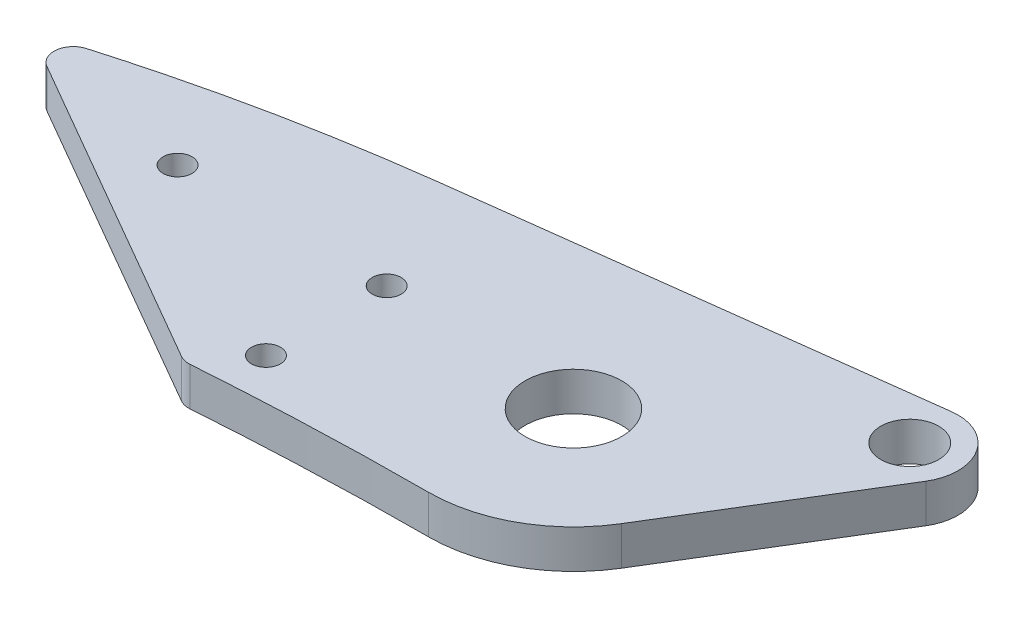
ISO-10303-21;
HEADER;
FILE_DESCRIPTION(('STEP AP214'),'2;1');
FILE_NAME('part.step','',(''),(''),'','','');
FILE_SCHEMA(('AUTOMOTIVE_DESIGN { 1 0 10303 214 1 1 1 1 }'));
ENDSEC;
DATA;
#1=APPLICATION_CONTEXT('core data for automotive mechanical design processes');
#2=APPLICATION_PROTOCOL_DEFINITION('international standard','automotive_design',2000,#1);
#3=PRODUCT_CONTEXT('',#1,'mechanical');
#4=PRODUCT('Part','Part','',(#3));
#5=PRODUCT_RELATED_PRODUCT_CATEGORY('part','',(#4));
#6=PRODUCT_DEFINITION_FORMATION('','',#4);
#7=PRODUCT_DEFINITION_CONTEXT('part definition',#1,'design');
#8=PRODUCT_DEFINITION('design','',#6,#7);
#9=PRODUCT_DEFINITION_SHAPE('','',#8);
#10=(LENGTH_UNIT() NAMED_UNIT(*) SI_UNIT(.MILLI.,.METRE.));
#11=(NAMED_UNIT(*) PLANE_ANGLE_UNIT() SI_UNIT($,.RADIAN.));
#12=(NAMED_UNIT(*) SI_UNIT($,.STERADIAN.) SOLID_ANGLE_UNIT());
#13=UNCERTAINTY_MEASURE_WITH_UNIT(LENGTH_MEASURE(1.E-05),#10,'distance_accuracy_value','');
#14=(GEOMETRIC_REPRESENTATION_CONTEXT(3) GLOBAL_UNCERTAINTY_ASSIGNED_CONTEXT((#13)) GLOBAL_UNIT_ASSIGNED_CONTEXT((#10,
#11,#12)) REPRESENTATION_CONTEXT('',''));
#15=CARTESIAN_POINT('',(0.,0.,0.));
#16=DIRECTION('',(0.,0.,1.));
#17=DIRECTION('',(1.,0.,0.));
#18=AXIS2_PLACEMENT_3D('',#15,#16,#17);
#19=CARTESIAN_POINT('',(0.,4.,0.));
#20=DIRECTION('',(0.,-1.,0.));
#21=DIRECTION('',(0.,0.,-1.));
#22=AXIS2_PLACEMENT_3D('',#19,#20,#21);
#23=CYLINDRICAL_SURFACE('',#22,15.);
#24=DIRECTION('',(0.,-1.,0.));
#25=VECTOR('',#24,1.);
#26=CARTESIAN_POINT('',(12.800284574999,4.,7.82002012779017));
#27=LINE('',#26,#25);
#28=CARTESIAN_POINT('',(12.800284574999,4.,7.82002012779017));
#29=VERTEX_POINT('',#28);
#30=CARTESIAN_POINT('',(12.800284574999,0.,7.82002012779017));
#31=VERTEX_POINT('',#30);
#32=EDGE_CURVE('E139',#29,#31,#27,.T.);
#33=ORIENTED_EDGE('',*,*,#32,.F.);
#34=CARTESIAN_POINT('',(0.,4.,0.));
#35=DIRECTION('',(0.,1.,0.));
#36=DIRECTION('',(0.,0.,1.));
#37=AXIS2_PLACEMENT_3D('',#34,#35,#36);
#38=CIRCLE('',#37,15.);
#39=CARTESIAN_POINT('',(0.,4.,15.));
#40=VERTEX_POINT('',#39);
#41=EDGE_CURVE('E126',#40,#29,#38,.T.);
#42=ORIENTED_EDGE('',*,*,#41,.F.);
#43=DIRECTION('',(0.,-1.,0.));
#44=VECTOR('',#43,1.);
#45=CARTESIAN_POINT('',(0.,4.,15.));
#46=LINE('',#45,#44);
#47=CARTESIAN_POINT('',(0.,0.,15.));
#48=VERTEX_POINT('',#47);
#49=EDGE_CURVE('E214',#40,#48,#46,.T.);
#50=ORIENTED_EDGE('',*,*,#49,.T.);
#51=CARTESIAN_POINT('',(0.,0.,0.));
#52=DIRECTION('',(0.,1.,0.));
#53=DIRECTION('',(0.,0.,1.));
#54=AXIS2_PLACEMENT_3D('',#51,#52,#53);
#55=CIRCLE('',#54,15.);
#56=EDGE_CURVE('E203',#48,#31,#55,.T.);
#57=ORIENTED_EDGE('',*,*,#56,.T.);
#58=EDGE_LOOP('',(#33,#42,#50,#57));
#59=FACE_BOUND('',#58,.T.);
#60=ADVANCED_FACE('F37',(#59),#23,.T.);
#61=CARTESIAN_POINT('',(0.,4.,15.));
#62=CARTESIAN_POINT('',(-49.2111716112706,4.,15.));
#63=CARTESIAN_POINT('',(-112.57781543997,4.,27.0169708024505));
#64=CARTESIAN_POINT('',(-144.167389056724,4.,51.5546731951299));
#65=B_SPLINE_CURVE_WITH_KNOTS('',3,(#61,#62,#63,#64),.UNSPECIFIED.,.F.,.F.,(4,4),(0.,1.),.UNSPECIFIED.);
#66=DIRECTION('',(0.,-1.,0.));
#67=VECTOR('',#66,1.);
#68=SURFACE_OF_LINEAR_EXTRUSION('',#65,#67);
#69=CARTESIAN_POINT('',(-23.8180350285036,4.,15.874105811846));
#70=VERTEX_POINT('',#69);
#71=EDGE_CURVE('E168',#40,#70,#65,.T.);
#72=ORIENTED_EDGE('',*,*,#71,.T.);
#73=DIRECTION('',(0.,-1.,0.));
#74=VECTOR('',#73,1.);
#75=CARTESIAN_POINT('',(-23.8180350285035,4.,15.874105811846));
#76=LINE('',#75,#74);
#77=CARTESIAN_POINT('',(-23.8180350285036,0.,15.874105811846));
#78=VERTEX_POINT('',#77);
#79=EDGE_CURVE('E62',#70,#78,#76,.T.);
#80=ORIENTED_EDGE('',*,*,#79,.T.);
#81=CARTESIAN_POINT('',(0.,0.,15.));
#82=CARTESIAN_POINT('',(-49.2111716112706,0.,15.));
#83=CARTESIAN_POINT('',(-112.57781543997,0.,27.0169708024505));
#84=CARTESIAN_POINT('',(-144.167389056724,0.,51.5546731951299));
#85=B_SPLINE_CURVE_WITH_KNOTS('',3,(#81,#82,#83,#84),.UNSPECIFIED.,.F.,.F.,(4,4),(0.,1.),.UNSPECIFIED.);
#86=EDGE_CURVE('E164',#48,#78,#85,.T.);
#87=ORIENTED_EDGE('',*,*,#86,.F.);
#88=ORIENTED_EDGE('',*,*,#49,.F.);
#89=EDGE_LOOP('',(#72,#80,#87,#88));
#90=FACE_BOUND('',#89,.T.);
#91=ADVANCED_FACE('F179',(#90),#68,.T.);
#92=CARTESIAN_POINT('',(0.,4.,-15.));
#93=CARTESIAN_POINT('',(-53.3333333333334,4.,-15.));
#94=CARTESIAN_POINT('',(-97.5832238129657,4.,2.85032711582573));
#95=CARTESIAN_POINT('',(-150.232513174223,4.,43.7464977702929));
#96=B_SPLINE_CURVE_WITH_KNOTS('',3,(#92,#93,#94,#95),.UNSPECIFIED.,.F.,.F.,(4,4),(0.,1.),.UNSPECIFIED.);
#97=DIRECTION('',(0.,-1.,0.));
#98=VECTOR('',#97,1.);
#99=SURFACE_OF_LINEAR_EXTRUSION('',#96,#98);
#100=CARTESIAN_POINT('',(0.,0.,-15.));
#101=CARTESIAN_POINT('',(-53.3333333333334,0.,-15.));
#102=CARTESIAN_POINT('',(-97.5832238129657,0.,2.85032711582573));
#103=CARTESIAN_POINT('',(-150.232513174223,0.,43.7464977702929));
#104=B_SPLINE_CURVE_WITH_KNOTS('',3,(#100,#101,#102,#103),.UNSPECIFIED.,.F.,.F.,(4,4),(0.,1.),.UNSPECIFIED.);
#105=CARTESIAN_POINT('',(-27.3151088710349,0.,-13.3250765524274));
#106=VERTEX_POINT('',#105);
#107=CARTESIAN_POINT('',(-57.4924891768514,0.,-7.07889253672707));
#108=VERTEX_POINT('',#107);
#109=EDGE_CURVE('E173',#106,#108,#104,.T.);
#110=ORIENTED_EDGE('',*,*,#109,.T.);
#111=DIRECTION('',(0.,-1.,0.));
#112=VECTOR('',#111,1.);
#113=CARTESIAN_POINT('',(-57.4924891768514,0.,-7.07889253672707));
#114=LINE('',#113,#112);
#115=CARTESIAN_POINT('',(-57.4924891768514,4.,-7.07889253672707));
#116=VERTEX_POINT('',#115);
#117=EDGE_CURVE('E11',#108,#116,#114,.F.);
#118=ORIENTED_EDGE('',*,*,#117,.T.);
#119=CARTESIAN_POINT('',(-27.3151088710349,4.,-13.3250765524274));
#120=VERTEX_POINT('',#119);
#121=EDGE_CURVE('E210',#120,#116,#96,.T.);
#122=ORIENTED_EDGE('',*,*,#121,.F.);
#123=DIRECTION('',(0.,-1.,0.));
#124=VECTOR('',#123,1.);
#125=CARTESIAN_POINT('',(-27.3151088710334,4.,-13.3250765524276));
#126=LINE('',#125,#124);
#127=EDGE_CURVE('E165',#120,#106,#126,.T.);
#128=ORIENTED_EDGE('',*,*,#127,.T.);
#129=EDGE_LOOP('',(#110,#118,#122,#128));
#130=FACE_BOUND('',#129,.T.);
#131=ADVANCED_FACE('F182',(#130),#99,.F.);
#132=CARTESIAN_POINT('',(0.,4.,0.));
#133=DIRECTION('',(0.,1.,0.));
#134=DIRECTION('',(0.,0.,1.));
#135=AXIS2_PLACEMENT_3D('',#132,#133,#134);
#136=PLANE('',#135);
#137=CARTESIAN_POINT('',(2.17326157070374E-11,4.,0.));
#138=DIRECTION('',(0.,1.,0.));
#139=DIRECTION('',(0.,0.,1.));
#140=AXIS2_PLACEMENT_3D('',#137,#138,#139);
#141=CIRCLE('',#140,5.00000000000001);
#142=CARTESIAN_POINT('',(2.17326157070374E-11,4.,4.99999999999995));
#143=VERTEX_POINT('',#142);
#144=EDGE_CURVE('E263',#143,#143,#141,.T.);
#145=ORIENTED_EDGE('',*,*,#144,.F.);
#146=EDGE_LOOP('',(#145));
#147=FACE_BOUND('',#146,.T.);
#148=CARTESIAN_POINT('',(-20.6760183596242,4.,-1.34329399811358));
#149=DIRECTION('',(0.,1.,0.));
#150=DIRECTION('',(0.,0.,1.));
#151=AXIS2_PLACEMENT_3D('',#148,#149,#150);
#152=CIRCLE('',#151,1.5);
#153=CARTESIAN_POINT('',(-20.6760183596242,4.,0.156706001886418));
#154=VERTEX_POINT('',#153);
#155=EDGE_CURVE('E300',#154,#154,#152,.T.);
#156=ORIENTED_EDGE('',*,*,#155,.F.);
#157=EDGE_LOOP('',(#156));
#158=FACE_BOUND('',#157,.T.);
#159=CARTESIAN_POINT('',(-20.6760183596242,4.,11.1567060018864));
#160=DIRECTION('',(0.,1.,0.));
#161=DIRECTION('',(0.,0.,1.));
#162=AXIS2_PLACEMENT_3D('',#159,#160,#161);
#163=CIRCLE('',#162,1.5);
#164=CARTESIAN_POINT('',(-20.6760183596242,4.,12.6567060018864));
#165=VERTEX_POINT('',#164);
#166=EDGE_CURVE('E296',#165,#165,#163,.T.);
#167=ORIENTED_EDGE('',*,*,#166,.F.);
#168=EDGE_LOOP('',(#167));
#169=FACE_BOUND('',#168,.T.);
#170=CARTESIAN_POINT('',(-42.3266534542352,4.,-1.34329399811358));
#171=DIRECTION('',(0.,1.,0.));
#172=DIRECTION('',(0.,0.,1.));
#173=AXIS2_PLACEMENT_3D('',#170,#171,#172);
#174=CIRCLE('',#173,1.5);
#175=CARTESIAN_POINT('',(-42.3266534542352,4.,0.156706001886425));
#176=VERTEX_POINT('',#175);
#177=EDGE_CURVE('E299',#176,#176,#174,.T.);
#178=ORIENTED_EDGE('',*,*,#177,.F.);
#179=EDGE_LOOP('',(#178));
#180=FACE_BOUND('',#179,.T.);
#181=DIRECTION('',(-0.866025403784436,0.,-0.500000000000004));
#182=VECTOR('',#181,1.);
#183=CARTESIAN_POINT('',(-61.9301247595717,4.,-5.73316020302551));
#184=LINE('',#183,#182);
#185=CARTESIAN_POINT('',(-24.9605392500153,4.,15.611239942746));
#186=VERTEX_POINT('',#185);
#187=CARTESIAN_POINT('',(-57.9344668261873,4.,-3.42626601959629));
#188=VERTEX_POINT('',#187);
#189=EDGE_CURVE('E151',#186,#188,#184,.T.);
#190=ORIENTED_EDGE('',*,*,#189,.F.);
#191=CARTESIAN_POINT('',(-23.9605392500153,4.,13.8791891351772));
#192=DIRECTION('',(0.,1.,0.));
#193=DIRECTION('',(0.,0.,1.));
#194=AXIS2_PLACEMENT_3D('',#191,#192,#193);
#195=CIRCLE('',#194,2.);
#196=EDGE_CURVE('E280',#186,#70,#195,.T.);
#197=ORIENTED_EDGE('',*,*,#196,.T.);
#198=ORIENTED_EDGE('',*,*,#71,.F.);
#199=ORIENTED_EDGE('',*,*,#41,.T.);
#200=DIRECTION('',(0.521334675186011,0.,-0.853352304999932));
#201=VECTOR('',#200,1.);
#202=CARTESIAN_POINT('',(12.800284574999,4.,7.82002012779017));
#203=LINE('',#202,#201);
#204=CARTESIAN_POINT('',(24.7455626322245,4.,-11.732737532846));
#205=VERTEX_POINT('',#204);
#206=EDGE_CURVE('E115',#29,#205,#203,.T.);
#207=ORIENTED_EDGE('',*,*,#206,.T.);
#208=CARTESIAN_POINT('',(20.4788011072249,4.,-14.339410908776));
#209=DIRECTION('',(0.,-1.,0.));
#210=DIRECTION('',(0.,0.,-1.));
#211=AXIS2_PLACEMENT_3D('',#208,#209,#210);
#212=CIRCLE('',#211,4.99999999999998);
#213=CARTESIAN_POINT('',(19.8504477530751,4.,-19.2997709826344));
#214=VERTEX_POINT('',#213);
#215=EDGE_CURVE('E122',#205,#214,#212,.F.);
#216=ORIENTED_EDGE('',*,*,#215,.T.);
#217=DIRECTION('',(-0.992072014771683,0.,0.125670670829965));
#218=VECTOR('',#217,1.);
#219=CARTESIAN_POINT('',(-2.09268605671381,4.,-16.5201256495056));
#220=LINE('',#219,#218);
#221=EDGE_CURVE('E129',#214,#120,#220,.T.);
#222=ORIENTED_EDGE('',*,*,#221,.T.);
#223=ORIENTED_EDGE('',*,*,#121,.T.);
#224=CARTESIAN_POINT('',(-56.9344668261873,4.,-5.15831682716517));
#225=DIRECTION('',(0.,1.,0.));
#226=DIRECTION('',(0.,0.,1.));
#227=AXIS2_PLACEMENT_3D('',#224,#225,#226);
#228=CIRCLE('',#227,2.);
#229=EDGE_CURVE('E211',#116,#188,#228,.T.);
#230=ORIENTED_EDGE('',*,*,#229,.T.);
#231=EDGE_LOOP('',(#190,#197,#198,#199,#207,#216,#222,#223,#230));
#232=FACE_BOUND('',#231,.T.);
#233=CARTESIAN_POINT('',(20.4788011072249,4.,-14.339410908776));
#234=DIRECTION('',(0.,-1.,0.));
#235=DIRECTION('',(0.,0.,-1.));
#236=AXIS2_PLACEMENT_3D('',#233,#234,#235);
#237=CIRCLE('',#236,3.);
#238=CARTESIAN_POINT('',(20.4788011072249,4.,-17.339410908776));
#239=VERTEX_POINT('',#238);
#240=EDGE_CURVE('E140',#239,#239,#237,.T.);
#241=ORIENTED_EDGE('',*,*,#240,.T.);
#242=EDGE_LOOP('',(#241));
#243=FACE_BOUND('',#242,.T.);
#244=ADVANCED_FACE('F118',(#147,#158,#169,#180,#232,#243),#136,.T.);
#245=CARTESIAN_POINT('',(0.,0.,0.));
#246=DIRECTION('',(0.,1.,0.));
#247=DIRECTION('',(0.,0.,1.));
#248=AXIS2_PLACEMENT_3D('',#245,#246,#247);
#249=PLANE('',#248);
#250=CARTESIAN_POINT('',(2.17326157070374E-11,0.,0.));
#251=DIRECTION('',(0.,1.,0.));
#252=DIRECTION('',(0.,0.,1.));
#253=AXIS2_PLACEMENT_3D('',#250,#251,#252);
#254=CIRCLE('',#253,5.00000000000001);
#255=CARTESIAN_POINT('',(2.17326157070374E-11,0.,4.99999999999995));
#256=VERTEX_POINT('',#255);
#257=EDGE_CURVE('E41',#256,#256,#254,.T.);
#258=ORIENTED_EDGE('',*,*,#257,.T.);
#259=EDGE_LOOP('',(#258));
#260=FACE_BOUND('',#259,.T.);
#261=CARTESIAN_POINT('',(-20.6760183596242,0.,-1.34329399811358));
#262=DIRECTION('',(0.,1.,0.));
#263=DIRECTION('',(0.,0.,1.));
#264=AXIS2_PLACEMENT_3D('',#261,#262,#263);
#265=CIRCLE('',#264,1.5);
#266=CARTESIAN_POINT('',(-20.6760183596242,0.,0.156706001886418));
#267=VERTEX_POINT('',#266);
#268=EDGE_CURVE('E266',#267,#267,#265,.T.);
#269=ORIENTED_EDGE('',*,*,#268,.T.);
#270=EDGE_LOOP('',(#269));
#271=FACE_BOUND('',#270,.T.);
#272=CARTESIAN_POINT('',(-20.6760183596242,0.,11.1567060018864));
#273=DIRECTION('',(0.,1.,0.));
#274=DIRECTION('',(0.,0.,1.));
#275=AXIS2_PLACEMENT_3D('',#272,#273,#274);
#276=CIRCLE('',#275,1.5);
#277=CARTESIAN_POINT('',(-20.6760183596242,0.,12.6567060018864));
#278=VERTEX_POINT('',#277);
#279=EDGE_CURVE('E268',#278,#278,#276,.T.);
#280=ORIENTED_EDGE('',*,*,#279,.T.);
#281=EDGE_LOOP('',(#280));
#282=FACE_BOUND('',#281,.T.);
#283=CARTESIAN_POINT('',(-42.3266534542352,0.,-1.34329399811358));
#284=DIRECTION('',(0.,1.,0.));
#285=DIRECTION('',(0.,0.,1.));
#286=AXIS2_PLACEMENT_3D('',#283,#284,#285);
#287=CIRCLE('',#286,1.5);
#288=CARTESIAN_POINT('',(-42.3266534542352,0.,0.156706001886425));
#289=VERTEX_POINT('',#288);
#290=EDGE_CURVE('E272',#289,#289,#287,.T.);
#291=ORIENTED_EDGE('',*,*,#290,.T.);
#292=EDGE_LOOP('',(#291));
#293=FACE_BOUND('',#292,.T.);
#294=ORIENTED_EDGE('',*,*,#86,.T.);
#295=CARTESIAN_POINT('',(-23.9605392500153,0.,13.8791891351772));
#296=DIRECTION('',(0.,1.,0.));
#297=DIRECTION('',(0.,0.,1.));
#298=AXIS2_PLACEMENT_3D('',#295,#296,#297);
#299=CIRCLE('',#298,2.);
#300=CARTESIAN_POINT('',(-24.9605392500153,0.,15.611239942746));
#301=VERTEX_POINT('',#300);
#302=EDGE_CURVE('E46',#78,#301,#299,.F.);
#303=ORIENTED_EDGE('',*,*,#302,.T.);
#304=DIRECTION('',(-0.866025403784436,0.,-0.500000000000004));
#305=VECTOR('',#304,1.);
#306=CARTESIAN_POINT('',(-61.9301247595717,0.,-5.73316020302551));
#307=LINE('',#306,#305);
#308=CARTESIAN_POINT('',(-57.9344668261873,0.,-3.42626601959629));
#309=VERTEX_POINT('',#308);
#310=EDGE_CURVE('E159',#301,#309,#307,.T.);
#311=ORIENTED_EDGE('',*,*,#310,.T.);
#312=CARTESIAN_POINT('',(-56.9344668261873,0.,-5.15831682716517));
#313=DIRECTION('',(0.,1.,0.));
#314=DIRECTION('',(0.,0.,1.));
#315=AXIS2_PLACEMENT_3D('',#312,#313,#314);
#316=CIRCLE('',#315,2.);
#317=EDGE_CURVE('E54',#309,#108,#316,.F.);
#318=ORIENTED_EDGE('',*,*,#317,.T.);
#319=ORIENTED_EDGE('',*,*,#109,.F.);
#320=DIRECTION('',(-0.992072014771683,0.,0.125670670829965));
#321=VECTOR('',#320,1.);
#322=CARTESIAN_POINT('',(-2.09268605671381,0.,-16.5201256495056));
#323=LINE('',#322,#321);
#324=CARTESIAN_POINT('',(19.8504477530751,0.,-19.2997709826344));
#325=VERTEX_POINT('',#324);
#326=EDGE_CURVE('E148',#325,#106,#323,.T.);
#327=ORIENTED_EDGE('',*,*,#326,.F.);
#328=CARTESIAN_POINT('',(20.4788011072249,0.,-14.339410908776));
#329=DIRECTION('',(0.,-1.,0.));
#330=DIRECTION('',(0.,0.,-1.));
#331=AXIS2_PLACEMENT_3D('',#328,#329,#330);
#332=CIRCLE('',#331,4.99999999999998);
#333=CARTESIAN_POINT('',(24.7455626322245,0.,-11.732737532846));
#334=VERTEX_POINT('',#333);
#335=EDGE_CURVE('E157',#334,#325,#332,.F.);
#336=ORIENTED_EDGE('',*,*,#335,.F.);
#337=DIRECTION('',(0.521334675186011,0.,-0.853352304999932));
#338=VECTOR('',#337,1.);
#339=CARTESIAN_POINT('',(12.800284574999,0.,7.82002012779017));
#340=LINE('',#339,#338);
#341=EDGE_CURVE('E135',#31,#334,#340,.T.);
#342=ORIENTED_EDGE('',*,*,#341,.F.);
#343=ORIENTED_EDGE('',*,*,#56,.F.);
#344=EDGE_LOOP('',(#294,#303,#311,#318,#319,#327,#336,#342,#343));
#345=FACE_BOUND('',#344,.T.);
#346=CARTESIAN_POINT('',(20.4788011072249,0.,-14.339410908776));
#347=DIRECTION('',(0.,-1.,0.));
#348=DIRECTION('',(0.,0.,-1.));
#349=AXIS2_PLACEMENT_3D('',#346,#347,#348);
#350=CIRCLE('',#349,3.);
#351=CARTESIAN_POINT('',(20.4788011072249,0.,-17.339410908776));
#352=VERTEX_POINT('',#351);
#353=EDGE_CURVE('E145',#352,#352,#350,.T.);
#354=ORIENTED_EDGE('',*,*,#353,.F.);
#355=EDGE_LOOP('',(#354));
#356=FACE_BOUND('',#355,.T.);
#357=ADVANCED_FACE('F204',(#260,#271,#282,#293,#345,#356),#249,.F.);
#358=CARTESIAN_POINT('',(20.4788011072249,4.,-14.339410908776));
#359=DIRECTION('',(0.,-1.,0.));
#360=DIRECTION('',(0.,0.,-1.));
#361=AXIS2_PLACEMENT_3D('',#358,#359,#360);
#362=CYLINDRICAL_SURFACE('',#361,4.99999999999998);
#363=ORIENTED_EDGE('',*,*,#335,.T.);
#364=DIRECTION('',(0.,-1.,0.));
#365=VECTOR('',#364,1.);
#366=CARTESIAN_POINT('',(19.8504477530751,4.,-19.2997709826344));
#367=LINE('',#366,#365);
#368=EDGE_CURVE('E144',#214,#325,#367,.T.);
#369=ORIENTED_EDGE('',*,*,#368,.F.);
#370=ORIENTED_EDGE('',*,*,#215,.F.);
#371=DIRECTION('',(0.,-1.,0.));
#372=VECTOR('',#371,1.);
#373=CARTESIAN_POINT('',(24.7455626322245,4.,-11.732737532846));
#374=LINE('',#373,#372);
#375=EDGE_CURVE('E132',#205,#334,#374,.T.);
#376=ORIENTED_EDGE('',*,*,#375,.T.);
#377=EDGE_LOOP('',(#363,#369,#370,#376));
#378=FACE_BOUND('',#377,.T.);
#379=ADVANCED_FACE('F142',(#378),#362,.T.);
#380=CARTESIAN_POINT('',(-2.09268605671381,4.,-16.5201256495056));
#381=DIRECTION('',(0.125670670829965,0.,0.992072014771683));
#382=DIRECTION('',(0.992072014771683,0.,-0.125670670829965));
#383=AXIS2_PLACEMENT_3D('',#380,#381,#382);
#384=PLANE('',#383);
#385=ORIENTED_EDGE('',*,*,#326,.T.);
#386=ORIENTED_EDGE('',*,*,#127,.F.);
#387=ORIENTED_EDGE('',*,*,#221,.F.);
#388=ORIENTED_EDGE('',*,*,#368,.T.);
#389=EDGE_LOOP('',(#385,#386,#387,#388));
#390=FACE_BOUND('',#389,.T.);
#391=ADVANCED_FACE('F208',(#390),#384,.F.);
#392=CARTESIAN_POINT('',(12.800284574999,4.,7.82002012779017));
#393=DIRECTION('',(-0.853352304999932,0.,-0.521334675186011));
#394=DIRECTION('',(-0.521334675186011,0.,0.853352304999932));
#395=AXIS2_PLACEMENT_3D('',#392,#393,#394);
#396=PLANE('',#395);
#397=ORIENTED_EDGE('',*,*,#341,.T.);
#398=ORIENTED_EDGE('',*,*,#375,.F.);
#399=ORIENTED_EDGE('',*,*,#206,.F.);
#400=ORIENTED_EDGE('',*,*,#32,.T.);
#401=EDGE_LOOP('',(#397,#398,#399,#400));
#402=FACE_BOUND('',#401,.T.);
#403=ADVANCED_FACE('F133',(#402),#396,.F.);
#404=CARTESIAN_POINT('',(20.4788011072249,4.,-14.339410908776));
#405=DIRECTION('',(0.,-1.,0.));
#406=DIRECTION('',(0.,0.,-1.));
#407=AXIS2_PLACEMENT_3D('',#404,#405,#406);
#408=CYLINDRICAL_SURFACE('',#407,3.);
#409=ORIENTED_EDGE('',*,*,#240,.F.);
#410=EDGE_LOOP('',(#409));
#411=FACE_BOUND('',#410,.T.);
#412=ORIENTED_EDGE('',*,*,#353,.T.);
#413=EDGE_LOOP('',(#412));
#414=FACE_BOUND('',#413,.T.);
#415=ADVANCED_FACE('F194',(#411,#414),#408,.F.);
#416=CARTESIAN_POINT('',(-61.9301247595717,0.,-5.73316020302551));
#417=DIRECTION('',(0.500000000000004,0.,-0.866025403784436));
#418=DIRECTION('',(-0.866025403784436,0.,-0.500000000000004));
#419=AXIS2_PLACEMENT_3D('',#416,#417,#418);
#420=PLANE('',#419);
#421=ORIENTED_EDGE('',*,*,#310,.F.);
#422=DIRECTION('',(0.,1.,0.));
#423=VECTOR('',#422,1.);
#424=CARTESIAN_POINT('',(-24.9605392500153,4.,15.611239942746));
#425=LINE('',#424,#423);
#426=EDGE_CURVE('E283',#301,#186,#425,.T.);
#427=ORIENTED_EDGE('',*,*,#426,.T.);
#428=ORIENTED_EDGE('',*,*,#189,.T.);
#429=DIRECTION('',(0.,-1.,0.));
#430=VECTOR('',#429,1.);
#431=CARTESIAN_POINT('',(-57.9344668261873,0.,-3.42626601959629));
#432=LINE('',#431,#430);
#433=EDGE_CURVE('E215',#188,#309,#432,.T.);
#434=ORIENTED_EDGE('',*,*,#433,.T.);
#435=EDGE_LOOP('',(#421,#427,#428,#434));
#436=FACE_BOUND('',#435,.T.);
#437=ADVANCED_FACE('F186',(#436),#420,.F.);
#438=CARTESIAN_POINT('',(-23.9605392500153,2.,13.8791891351772));
#439=DIRECTION('',(0.,-1.,0.));
#440=DIRECTION('',(0.,0.,-1.));
#441=AXIS2_PLACEMENT_3D('',#438,#439,#440);
#442=CYLINDRICAL_SURFACE('',#441,2.);
#443=ORIENTED_EDGE('',*,*,#302,.F.);
#444=ORIENTED_EDGE('',*,*,#79,.F.);
#445=ORIENTED_EDGE('',*,*,#196,.F.);
#446=ORIENTED_EDGE('',*,*,#426,.F.);
#447=EDGE_LOOP('',(#443,#444,#445,#446));
#448=FACE_BOUND('',#447,.T.);
#449=ADVANCED_FACE('F184',(#448),#442,.T.);
#450=CARTESIAN_POINT('',(-56.9344668261873,2.,-5.15831682716517));
#451=DIRECTION('',(0.,-1.,0.));
#452=DIRECTION('',(0.,0.,-1.));
#453=AXIS2_PLACEMENT_3D('',#450,#451,#452);
#454=CYLINDRICAL_SURFACE('',#453,2.);
#455=ORIENTED_EDGE('',*,*,#317,.F.);
#456=ORIENTED_EDGE('',*,*,#433,.F.);
#457=ORIENTED_EDGE('',*,*,#229,.F.);
#458=ORIENTED_EDGE('',*,*,#117,.F.);
#459=EDGE_LOOP('',(#455,#456,#457,#458));
#460=FACE_BOUND('',#459,.T.);
#461=ADVANCED_FACE('F39',(#460),#454,.T.);
#462=CARTESIAN_POINT('',(-42.3266534542352,-6.,-1.34329399811358));
#463=DIRECTION('',(0.,1.,0.));
#464=DIRECTION('',(0.,0.,1.));
#465=AXIS2_PLACEMENT_3D('',#462,#463,#464);
#466=CYLINDRICAL_SURFACE('',#465,1.5);
#467=ORIENTED_EDGE('',*,*,#177,.T.);
#468=EDGE_LOOP('',(#467));
#469=FACE_BOUND('',#468,.T.);
#470=ORIENTED_EDGE('',*,*,#290,.F.);
#471=EDGE_LOOP('',(#470));
#472=FACE_BOUND('',#471,.T.);
#473=ADVANCED_FACE('F192',(#469,#472),#466,.F.);
#474=CARTESIAN_POINT('',(-20.6760183596242,-6.,11.1567060018864));
#475=DIRECTION('',(0.,1.,0.));
#476=DIRECTION('',(0.,0.,1.));
#477=AXIS2_PLACEMENT_3D('',#474,#475,#476);
#478=CYLINDRICAL_SURFACE('',#477,1.5);
#479=ORIENTED_EDGE('',*,*,#166,.T.);
#480=EDGE_LOOP('',(#479));
#481=FACE_BOUND('',#480,.T.);
#482=ORIENTED_EDGE('',*,*,#279,.F.);
#483=EDGE_LOOP('',(#482));
#484=FACE_BOUND('',#483,.T.);
#485=ADVANCED_FACE('F244',(#481,#484),#478,.F.);
#486=CARTESIAN_POINT('',(-20.6760183596242,-6.,-1.34329399811358));
#487=DIRECTION('',(0.,1.,0.));
#488=DIRECTION('',(0.,0.,1.));
#489=AXIS2_PLACEMENT_3D('',#486,#487,#488);
#490=CYLINDRICAL_SURFACE('',#489,1.5);
#491=ORIENTED_EDGE('',*,*,#155,.T.);
#492=EDGE_LOOP('',(#491));
#493=FACE_BOUND('',#492,.T.);
#494=ORIENTED_EDGE('',*,*,#268,.F.);
#495=EDGE_LOOP('',(#494));
#496=FACE_BOUND('',#495,.T.);
#497=ADVANCED_FACE('F247',(#493,#496),#490,.F.);
#498=CARTESIAN_POINT('',(2.17326157070374E-11,-6.,0.));
#499=DIRECTION('',(0.,1.,0.));
#500=DIRECTION('',(0.,0.,1.));
#501=AXIS2_PLACEMENT_3D('',#498,#499,#500);
#502=CYLINDRICAL_SURFACE('',#501,5.00000000000001);
#503=ORIENTED_EDGE('',*,*,#144,.T.);
#504=EDGE_LOOP('',(#503));
#505=FACE_BOUND('',#504,.T.);
#506=ORIENTED_EDGE('',*,*,#257,.F.);
#507=EDGE_LOOP('',(#506));
#508=FACE_BOUND('',#507,.T.);
#509=ADVANCED_FACE('F254',(#505,#508),#502,.F.);
#510=CLOSED_SHELL('',(#60,#91,#131,#244,#357,#379,#391,#403,#415,#437,#449,#461,#473,#485,#497,#509));
#511=MANIFOLD_SOLID_BREP('B2',#510);
#512=ADVANCED_BREP_SHAPE_REPRESENTATION('',(#18,#511),#14);
#513=SHAPE_DEFINITION_REPRESENTATION(#9,#512);
ENDSEC;
END-ISO-10303-21;
